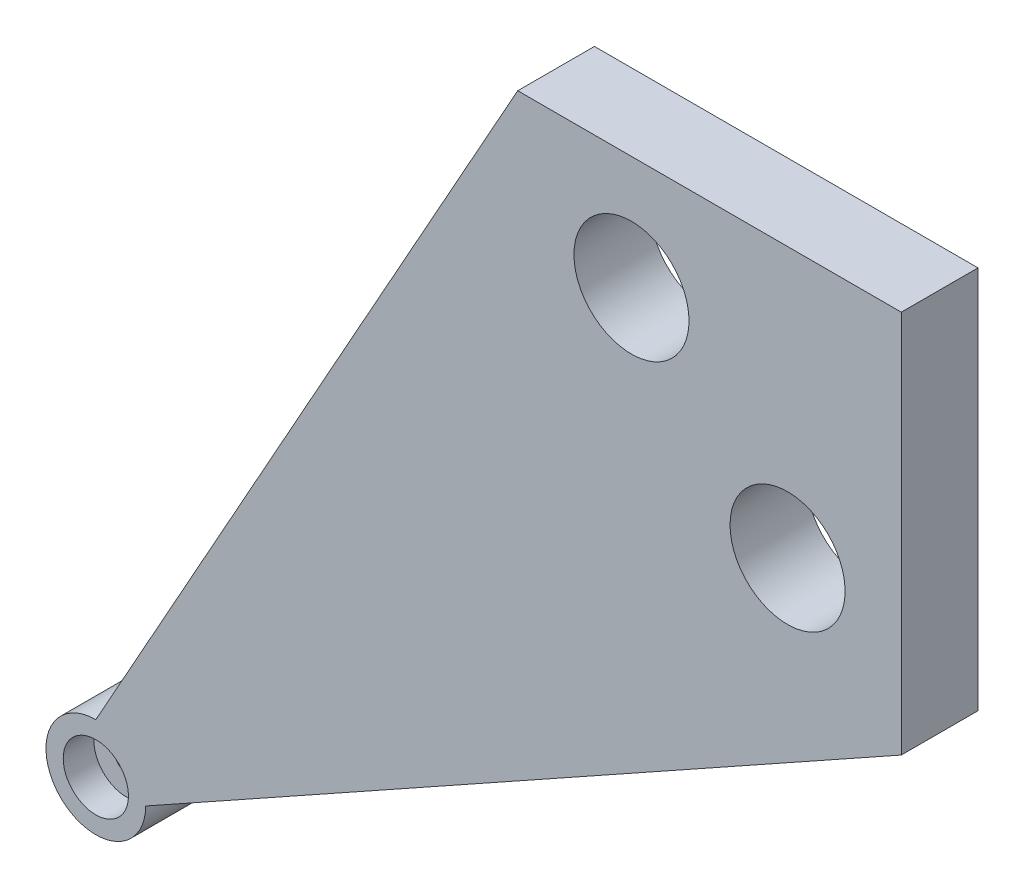
ISO-10303-21;
HEADER;
FILE_DESCRIPTION(('STEP AP214'),'2;1');
FILE_NAME('part.step','',(''),(''),'','','');
FILE_SCHEMA(('AUTOMOTIVE_DESIGN { 1 0 10303 214 1 1 1 1 }'));
ENDSEC;
DATA;
#1=APPLICATION_CONTEXT('core data for automotive mechanical design processes');
#2=APPLICATION_PROTOCOL_DEFINITION('international standard','automotive_design',2000,#1);
#3=PRODUCT_CONTEXT('',#1,'mechanical');
#4=PRODUCT('Part','Part','',(#3));
#5=PRODUCT_RELATED_PRODUCT_CATEGORY('part','',(#4));
#6=PRODUCT_DEFINITION_FORMATION('','',#4);
#7=PRODUCT_DEFINITION_CONTEXT('part definition',#1,'design');
#8=PRODUCT_DEFINITION('design','',#6,#7);
#9=PRODUCT_DEFINITION_SHAPE('','',#8);
#10=(LENGTH_UNIT() NAMED_UNIT(*) SI_UNIT(.MILLI.,.METRE.));
#11=(NAMED_UNIT(*) PLANE_ANGLE_UNIT() SI_UNIT($,.RADIAN.));
#12=(NAMED_UNIT(*) SI_UNIT($,.STERADIAN.) SOLID_ANGLE_UNIT());
#13=UNCERTAINTY_MEASURE_WITH_UNIT(LENGTH_MEASURE(1.E-05),#10,'distance_accuracy_value','');
#14=(GEOMETRIC_REPRESENTATION_CONTEXT(3) GLOBAL_UNCERTAINTY_ASSIGNED_CONTEXT((#13)) GLOBAL_UNIT_ASSIGNED_CONTEXT((#10,
#11,#12)) REPRESENTATION_CONTEXT('',''));
#15=CARTESIAN_POINT('',(0.,0.,0.));
#16=DIRECTION('',(0.,0.,1.));
#17=DIRECTION('',(1.,0.,0.));
#18=AXIS2_PLACEMENT_3D('',#15,#16,#17);
#19=CARTESIAN_POINT('',(0.,0.,5.));
#20=DIRECTION('',(-1.,0.,0.));
#21=DIRECTION('',(0.,-1.,0.));
#22=AXIS2_PLACEMENT_3D('',#19,#20,#21);
#23=PLANE('',#22);
#24=DIRECTION('',(0.,1.,0.));
#25=VECTOR('',#24,1.);
#26=CARTESIAN_POINT('',(0.,0.,-5.));
#27=LINE('',#26,#25);
#28=CARTESIAN_POINT('',(0.,-50.,-5.));
#29=VERTEX_POINT('',#28);
#30=CARTESIAN_POINT('',(0.,0.,-5.));
#31=VERTEX_POINT('',#30);
#32=EDGE_CURVE('E131',#29,#31,#27,.T.);
#33=ORIENTED_EDGE('',*,*,#32,.T.);
#34=DIRECTION('',(0.,0.,-1.));
#35=VECTOR('',#34,1.);
#36=CARTESIAN_POINT('',(0.,0.,5.));
#37=LINE('',#36,#35);
#38=CARTESIAN_POINT('',(0.,0.,5.));
#39=VERTEX_POINT('',#38);
#40=EDGE_CURVE('E11',#39,#31,#37,.T.);
#41=ORIENTED_EDGE('',*,*,#40,.F.);
#42=DIRECTION('',(0.,1.,0.));
#43=VECTOR('',#42,1.);
#44=CARTESIAN_POINT('',(0.,0.,5.));
#45=LINE('',#44,#43);
#46=CARTESIAN_POINT('',(0.,-50.,5.));
#47=VERTEX_POINT('',#46);
#48=EDGE_CURVE('E121',#47,#39,#45,.T.);
#49=ORIENTED_EDGE('',*,*,#48,.F.);
#50=DIRECTION('',(0.,0.,-1.));
#51=VECTOR('',#50,1.);
#52=CARTESIAN_POINT('',(0.,-50.,5.));
#53=LINE('',#52,#51);
#54=EDGE_CURVE('E114',#47,#29,#53,.T.);
#55=ORIENTED_EDGE('',*,*,#54,.T.);
#56=EDGE_LOOP('',(#33,#41,#49,#55));
#57=FACE_BOUND('',#56,.T.);
#58=ADVANCED_FACE('F38',(#57),#23,.F.);
#59=CARTESIAN_POINT('',(0.,0.,5.));
#60=DIRECTION('',(0.,-1.,0.));
#61=DIRECTION('',(0.,0.,1.));
#62=AXIS2_PLACEMENT_3D('',#59,#60,#61);
#63=PLANE('',#62);
#64=DIRECTION('',(-1.,0.,0.));
#65=VECTOR('',#64,1.);
#66=CARTESIAN_POINT('',(0.,0.,-5.));
#67=LINE('',#66,#65);
#68=CARTESIAN_POINT('',(-50.,0.,-5.));
#69=VERTEX_POINT('',#68);
#70=EDGE_CURVE('E127',#31,#69,#67,.T.);
#71=ORIENTED_EDGE('',*,*,#70,.T.);
#72=DIRECTION('',(0.,0.,-1.));
#73=VECTOR('',#72,1.);
#74=CARTESIAN_POINT('',(-50.,0.,5.));
#75=LINE('',#74,#73);
#76=CARTESIAN_POINT('',(-50.,0.,5.));
#77=VERTEX_POINT('',#76);
#78=EDGE_CURVE('E47',#77,#69,#75,.T.);
#79=ORIENTED_EDGE('',*,*,#78,.F.);
#80=DIRECTION('',(-1.,0.,0.));
#81=VECTOR('',#80,1.);
#82=CARTESIAN_POINT('',(0.,0.,5.));
#83=LINE('',#82,#81);
#84=EDGE_CURVE('E85',#39,#77,#83,.T.);
#85=ORIENTED_EDGE('',*,*,#84,.F.);
#86=ORIENTED_EDGE('',*,*,#40,.T.);
#87=EDGE_LOOP('',(#71,#79,#85,#86));
#88=FACE_BOUND('',#87,.T.);
#89=ADVANCED_FACE('F207',(#88),#63,.F.);
#90=CARTESIAN_POINT('',(-50.,0.,5.));
#91=DIRECTION('',(0.873109961084313,-0.487523328524235,0.));
#92=DIRECTION('',(0.487523328524235,0.873109961084313,0.));
#93=AXIS2_PLACEMENT_3D('',#90,#91,#92);
#94=PLANE('',#93);
#95=DIRECTION('',(-0.487523328524235,-0.873109961084313,0.));
#96=VECTOR('',#95,1.);
#97=CARTESIAN_POINT('',(-50.,0.,-5.));
#98=LINE('',#97,#96);
#99=CARTESIAN_POINT('',(-105.,-98.5,-5.));
#100=VERTEX_POINT('',#99);
#101=EDGE_CURVE('E109',#69,#100,#98,.T.);
#102=ORIENTED_EDGE('',*,*,#101,.T.);
#103=DIRECTION('',(0.,0.,-1.));
#104=VECTOR('',#103,1.);
#105=CARTESIAN_POINT('',(-105.,-98.5,5.));
#106=LINE('',#105,#104);
#107=CARTESIAN_POINT('',(-105.,-98.5,5.));
#108=VERTEX_POINT('',#107);
#109=EDGE_CURVE('E97',#108,#100,#106,.T.);
#110=ORIENTED_EDGE('',*,*,#109,.F.);
#111=DIRECTION('',(-0.487523328524235,-0.873109961084313,0.));
#112=VECTOR('',#111,1.);
#113=CARTESIAN_POINT('',(-50.,0.,5.));
#114=LINE('',#113,#112);
#115=EDGE_CURVE('E101',#77,#108,#114,.T.);
#116=ORIENTED_EDGE('',*,*,#115,.F.);
#117=ORIENTED_EDGE('',*,*,#78,.T.);
#118=EDGE_LOOP('',(#102,#110,#116,#117));
#119=FACE_BOUND('',#118,.T.);
#120=ADVANCED_FACE('F108',(#119),#94,.F.);
#121=CARTESIAN_POINT('',(-105.,-105.,5.));
#122=DIRECTION('',(0.,0.,-1.));
#123=DIRECTION('',(1.,0.,0.));
#124=AXIS2_PLACEMENT_3D('',#121,#122,#123);
#125=CYLINDRICAL_SURFACE('',#124,6.50000000000001);
#126=CARTESIAN_POINT('',(-105.,-105.,-5.));
#127=DIRECTION('',(0.,0.,1.));
#128=DIRECTION('',(-1.,0.,0.));
#129=AXIS2_PLACEMENT_3D('',#126,#127,#128);
#130=CIRCLE('',#129,6.50000000000001);
#131=CARTESIAN_POINT('',(-98.4999999999999,-105.,-5.));
#132=VERTEX_POINT('',#131);
#133=EDGE_CURVE('E122',#100,#132,#130,.T.);
#134=ORIENTED_EDGE('',*,*,#133,.T.);
#135=DIRECTION('',(0.,0.,-1.));
#136=VECTOR('',#135,1.);
#137=CARTESIAN_POINT('',(-98.4999999999999,-105.,5.));
#138=LINE('',#137,#136);
#139=CARTESIAN_POINT('',(-98.4999999999999,-105.,5.));
#140=VERTEX_POINT('',#139);
#141=EDGE_CURVE('E99',#140,#132,#138,.T.);
#142=ORIENTED_EDGE('',*,*,#141,.F.);
#143=CARTESIAN_POINT('',(-105.,-105.,5.));
#144=DIRECTION('',(0.,0.,1.));
#145=DIRECTION('',(-1.,0.,0.));
#146=AXIS2_PLACEMENT_3D('',#143,#144,#145);
#147=CIRCLE('',#146,6.50000000000001);
#148=EDGE_CURVE('E92',#108,#140,#147,.T.);
#149=ORIENTED_EDGE('',*,*,#148,.F.);
#150=ORIENTED_EDGE('',*,*,#109,.T.);
#151=EDGE_LOOP('',(#134,#142,#149,#150));
#152=FACE_BOUND('',#151,.T.);
#153=ADVANCED_FACE('F95',(#152),#125,.T.);
#154=CARTESIAN_POINT('',(0.,-50.,5.));
#155=DIRECTION('',(-0.487523328524236,0.873109961084313,0.));
#156=DIRECTION('',(-0.873109961084313,-0.487523328524236,0.));
#157=AXIS2_PLACEMENT_3D('',#154,#155,#156);
#158=PLANE('',#157);
#159=DIRECTION('',(0.873109961084313,0.487523328524236,0.));
#160=VECTOR('',#159,1.);
#161=CARTESIAN_POINT('',(0.,-50.,-5.));
#162=LINE('',#161,#160);
#163=EDGE_CURVE('E74',#132,#29,#162,.T.);
#164=ORIENTED_EDGE('',*,*,#163,.T.);
#165=ORIENTED_EDGE('',*,*,#54,.F.);
#166=DIRECTION('',(0.873109961084313,0.487523328524236,0.));
#167=VECTOR('',#166,1.);
#168=CARTESIAN_POINT('',(0.,-50.,5.));
#169=LINE('',#168,#167);
#170=EDGE_CURVE('E55',#140,#47,#169,.T.);
#171=ORIENTED_EDGE('',*,*,#170,.F.);
#172=ORIENTED_EDGE('',*,*,#141,.T.);
#173=EDGE_LOOP('',(#164,#165,#171,#172));
#174=FACE_BOUND('',#173,.T.);
#175=ADVANCED_FACE('F186',(#174),#158,.F.);
#176=CARTESIAN_POINT('',(-105.,-105.,5.));
#177=DIRECTION('',(0.,0.,1.));
#178=DIRECTION('',(-1.,0.,0.));
#179=AXIS2_PLACEMENT_3D('',#176,#177,#178);
#180=PLANE('',#179);
#181=CARTESIAN_POINT('',(-14.8255588340632,-35.1744411659368,5.));
#182=DIRECTION('',(0.,0.,1.));
#183=DIRECTION('',(-1.,0.,0.));
#184=AXIS2_PLACEMENT_3D('',#181,#182,#183);
#185=CIRCLE('',#184,7.5);
#186=CARTESIAN_POINT('',(-22.3255588340632,-35.1744411659368,5.));
#187=VERTEX_POINT('',#186);
#188=EDGE_CURVE('E166',#187,#187,#185,.T.);
#189=ORIENTED_EDGE('',*,*,#188,.F.);
#190=EDGE_LOOP('',(#189));
#191=FACE_BOUND('',#190,.T.);
#192=CARTESIAN_POINT('',(-35.1744411659368,-14.8255588340632,5.));
#193=DIRECTION('',(0.,0.,1.));
#194=DIRECTION('',(-1.,0.,0.));
#195=AXIS2_PLACEMENT_3D('',#192,#193,#194);
#196=CIRCLE('',#195,7.5);
#197=CARTESIAN_POINT('',(-42.6744411659368,-14.8255588340633,5.));
#198=VERTEX_POINT('',#197);
#199=EDGE_CURVE('E158',#198,#198,#196,.T.);
#200=ORIENTED_EDGE('',*,*,#199,.F.);
#201=EDGE_LOOP('',(#200));
#202=FACE_BOUND('',#201,.T.);
#203=CARTESIAN_POINT('',(-105.,-105.,5.));
#204=DIRECTION('',(0.,0.,1.));
#205=DIRECTION('',(-1.,0.,0.));
#206=AXIS2_PLACEMENT_3D('',#203,#204,#205);
#207=CIRCLE('',#206,4.25000000000001);
#208=CARTESIAN_POINT('',(-109.25,-105.,5.));
#209=VERTEX_POINT('',#208);
#210=EDGE_CURVE('E142',#209,#209,#207,.T.);
#211=ORIENTED_EDGE('',*,*,#210,.F.);
#212=EDGE_LOOP('',(#211));
#213=FACE_BOUND('',#212,.T.);
#214=ORIENTED_EDGE('',*,*,#48,.T.);
#215=ORIENTED_EDGE('',*,*,#84,.T.);
#216=ORIENTED_EDGE('',*,*,#115,.T.);
#217=ORIENTED_EDGE('',*,*,#148,.T.);
#218=ORIENTED_EDGE('',*,*,#170,.T.);
#219=EDGE_LOOP('',(#214,#215,#216,#217,#218));
#220=FACE_BOUND('',#219,.T.);
#221=ADVANCED_FACE('F103',(#191,#202,#213,#220),#180,.T.);
#222=CARTESIAN_POINT('',(-105.,-105.,-5.));
#223=DIRECTION('',(0.,0.,1.));
#224=DIRECTION('',(-1.,0.,0.));
#225=AXIS2_PLACEMENT_3D('',#222,#223,#224);
#226=PLANE('',#225);
#227=CARTESIAN_POINT('',(-14.8255588340632,-35.1744411659368,-5.));
#228=DIRECTION('',(0.,0.,1.));
#229=DIRECTION('',(-1.,0.,0.));
#230=AXIS2_PLACEMENT_3D('',#227,#228,#229);
#231=CIRCLE('',#230,7.5);
#232=CARTESIAN_POINT('',(-22.3255588340632,-35.1744411659368,-5.));
#233=VERTEX_POINT('',#232);
#234=EDGE_CURVE('E154',#233,#233,#231,.T.);
#235=ORIENTED_EDGE('',*,*,#234,.T.);
#236=EDGE_LOOP('',(#235));
#237=FACE_BOUND('',#236,.T.);
#238=CARTESIAN_POINT('',(-35.1744411659368,-14.8255588340632,-5.));
#239=DIRECTION('',(0.,0.,1.));
#240=DIRECTION('',(-1.,0.,0.));
#241=AXIS2_PLACEMENT_3D('',#238,#239,#240);
#242=CIRCLE('',#241,7.5);
#243=CARTESIAN_POINT('',(-42.6744411659368,-14.8255588340633,-5.));
#244=VERTEX_POINT('',#243);
#245=EDGE_CURVE('E162',#244,#244,#242,.T.);
#246=ORIENTED_EDGE('',*,*,#245,.T.);
#247=EDGE_LOOP('',(#246));
#248=FACE_BOUND('',#247,.T.);
#249=CARTESIAN_POINT('',(-105.,-105.,-5.));
#250=DIRECTION('',(0.,0.,1.));
#251=DIRECTION('',(-1.,0.,0.));
#252=AXIS2_PLACEMENT_3D('',#249,#250,#251);
#253=CIRCLE('',#252,1.5);
#254=CARTESIAN_POINT('',(-106.5,-105.,-5.));
#255=VERTEX_POINT('',#254);
#256=EDGE_CURVE('E146',#255,#255,#253,.T.);
#257=ORIENTED_EDGE('',*,*,#256,.T.);
#258=EDGE_LOOP('',(#257));
#259=FACE_BOUND('',#258,.T.);
#260=ORIENTED_EDGE('',*,*,#32,.F.);
#261=ORIENTED_EDGE('',*,*,#163,.F.);
#262=ORIENTED_EDGE('',*,*,#133,.F.);
#263=ORIENTED_EDGE('',*,*,#101,.F.);
#264=ORIENTED_EDGE('',*,*,#70,.F.);
#265=EDGE_LOOP('',(#260,#261,#262,#263,#264));
#266=FACE_BOUND('',#265,.T.);
#267=ADVANCED_FACE('F174',(#237,#248,#259,#266),#226,.F.);
#268=CARTESIAN_POINT('',(-105.,-105.,1.));
#269=DIRECTION('',(0.,0.,1.));
#270=DIRECTION('',(-1.,0.,0.));
#271=AXIS2_PLACEMENT_3D('',#268,#269,#270);
#272=CYLINDRICAL_SURFACE('',#271,4.25000000000001);
#273=CARTESIAN_POINT('',(-105.,-105.,1.));
#274=DIRECTION('',(0.,0.,1.));
#275=DIRECTION('',(-1.,0.,0.));
#276=AXIS2_PLACEMENT_3D('',#273,#274,#275);
#277=CIRCLE('',#276,4.25000000000001);
#278=CARTESIAN_POINT('',(-109.25,-105.,1.));
#279=VERTEX_POINT('',#278);
#280=EDGE_CURVE('E135',#279,#279,#277,.T.);
#281=ORIENTED_EDGE('',*,*,#280,.F.);
#282=EDGE_LOOP('',(#281));
#283=FACE_BOUND('',#282,.T.);
#284=ORIENTED_EDGE('',*,*,#210,.T.);
#285=EDGE_LOOP('',(#284));
#286=FACE_BOUND('',#285,.T.);
#287=ADVANCED_FACE('F192',(#283,#286),#272,.F.);
#288=CARTESIAN_POINT('',(-105.,-105.,1.));
#289=DIRECTION('',(0.,0.,1.));
#290=DIRECTION('',(-1.,0.,0.));
#291=AXIS2_PLACEMENT_3D('',#288,#289,#290);
#292=PLANE('',#291);
#293=CARTESIAN_POINT('',(-105.,-105.,1.));
#294=DIRECTION('',(0.,0.,1.));
#295=DIRECTION('',(-1.,0.,0.));
#296=AXIS2_PLACEMENT_3D('',#293,#294,#295);
#297=CIRCLE('',#296,1.5);
#298=CARTESIAN_POINT('',(-106.5,-105.,1.));
#299=VERTEX_POINT('',#298);
#300=EDGE_CURVE('E150',#299,#299,#297,.T.);
#301=ORIENTED_EDGE('',*,*,#300,.F.);
#302=EDGE_LOOP('',(#301));
#303=FACE_BOUND('',#302,.T.);
#304=ORIENTED_EDGE('',*,*,#280,.T.);
#305=EDGE_LOOP('',(#304));
#306=FACE_BOUND('',#305,.T.);
#307=ADVANCED_FACE('F194',(#303,#306),#292,.T.);
#308=CARTESIAN_POINT('',(-105.,-105.,-5.));
#309=DIRECTION('',(0.,0.,1.));
#310=DIRECTION('',(-1.,0.,0.));
#311=AXIS2_PLACEMENT_3D('',#308,#309,#310);
#312=CYLINDRICAL_SURFACE('',#311,1.5);
#313=ORIENTED_EDGE('',*,*,#256,.F.);
#314=EDGE_LOOP('',(#313));
#315=FACE_BOUND('',#314,.T.);
#316=ORIENTED_EDGE('',*,*,#300,.T.);
#317=EDGE_LOOP('',(#316));
#318=FACE_BOUND('',#317,.T.);
#319=ADVANCED_FACE('F201',(#315,#318),#312,.F.);
#320=CARTESIAN_POINT('',(-35.1744411659368,-14.8255588340632,-5.));
#321=DIRECTION('',(0.,0.,1.));
#322=DIRECTION('',(-1.,0.,0.));
#323=AXIS2_PLACEMENT_3D('',#320,#321,#322);
#324=CYLINDRICAL_SURFACE('',#323,7.5);
#325=ORIENTED_EDGE('',*,*,#245,.F.);
#326=EDGE_LOOP('',(#325));
#327=FACE_BOUND('',#326,.T.);
#328=ORIENTED_EDGE('',*,*,#199,.T.);
#329=EDGE_LOOP('',(#328));
#330=FACE_BOUND('',#329,.T.);
#331=ADVANCED_FACE('F180',(#327,#330),#324,.F.);
#332=CARTESIAN_POINT('',(-14.8255588340632,-35.1744411659368,-5.));
#333=DIRECTION('',(0.,0.,1.));
#334=DIRECTION('',(-1.,0.,0.));
#335=AXIS2_PLACEMENT_3D('',#332,#333,#334);
#336=CYLINDRICAL_SURFACE('',#335,7.5);
#337=ORIENTED_EDGE('',*,*,#234,.F.);
#338=EDGE_LOOP('',(#337));
#339=FACE_BOUND('',#338,.T.);
#340=ORIENTED_EDGE('',*,*,#188,.T.);
#341=EDGE_LOOP('',(#340));
#342=FACE_BOUND('',#341,.T.);
#343=ADVANCED_FACE('F177',(#339,#342),#336,.F.);
#344=CLOSED_SHELL('',(#58,#89,#120,#153,#175,#221,#267,#287,#307,#319,#331,#343));
#345=MANIFOLD_SOLID_BREP('B2',#344);
#346=ADVANCED_BREP_SHAPE_REPRESENTATION('',(#18,#345),#14);
#347=SHAPE_DEFINITION_REPRESENTATION(#9,#346);
ENDSEC;
END-ISO-10303-21;
